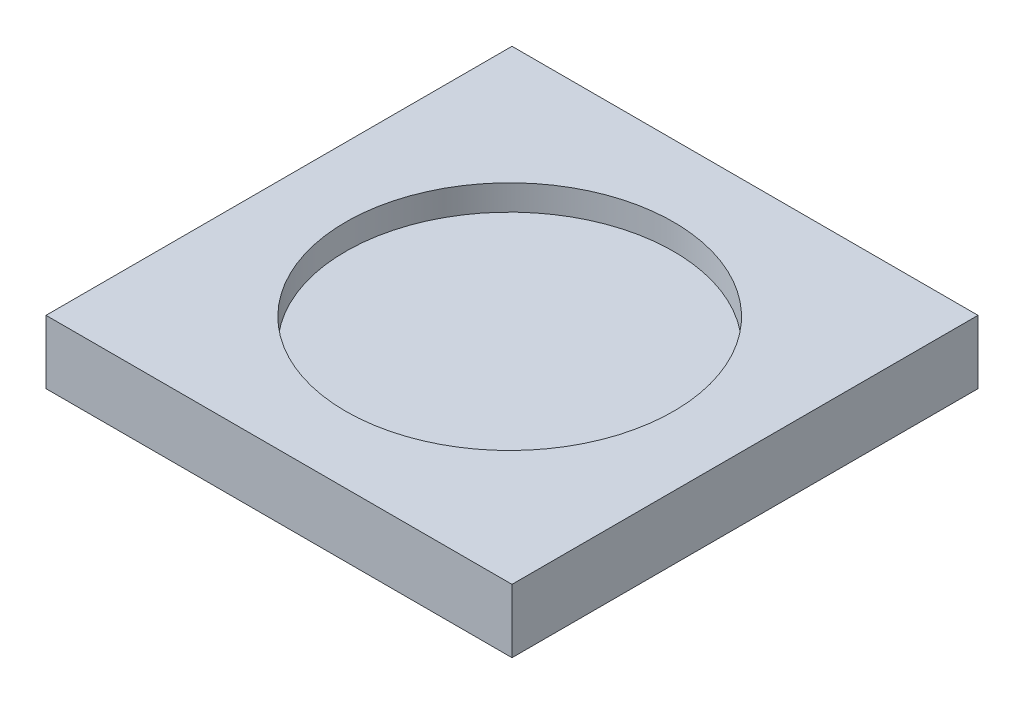
ISO-10303-21;
HEADER;
FILE_DESCRIPTION(('STEP AP214'),'2;1');
FILE_NAME('part.step','',(''),(''),'','','');
FILE_SCHEMA(('AUTOMOTIVE_DESIGN { 1 0 10303 214 1 1 1 1 }'));
ENDSEC;
DATA;
#1=APPLICATION_CONTEXT('core data for automotive mechanical design processes');
#2=APPLICATION_PROTOCOL_DEFINITION('international standard','automotive_design',2000,#1);
#3=PRODUCT_CONTEXT('',#1,'mechanical');
#4=PRODUCT('Part','Part','',(#3));
#5=PRODUCT_RELATED_PRODUCT_CATEGORY('part','',(#4));
#6=PRODUCT_DEFINITION_FORMATION('','',#4);
#7=PRODUCT_DEFINITION_CONTEXT('part definition',#1,'design');
#8=PRODUCT_DEFINITION('design','',#6,#7);
#9=PRODUCT_DEFINITION_SHAPE('','',#8);
#10=(LENGTH_UNIT() NAMED_UNIT(*) SI_UNIT(.MILLI.,.METRE.));
#11=(NAMED_UNIT(*) PLANE_ANGLE_UNIT() SI_UNIT($,.RADIAN.));
#12=(NAMED_UNIT(*) SI_UNIT($,.STERADIAN.) SOLID_ANGLE_UNIT());
#13=UNCERTAINTY_MEASURE_WITH_UNIT(LENGTH_MEASURE(1.E-05),#10,'distance_accuracy_value','');
#14=(GEOMETRIC_REPRESENTATION_CONTEXT(3) GLOBAL_UNCERTAINTY_ASSIGNED_CONTEXT((#13)) GLOBAL_UNIT_ASSIGNED_CONTEXT((#10,
#11,#12)) REPRESENTATION_CONTEXT('',''));
#15=CARTESIAN_POINT('',(0.,0.,0.));
#16=DIRECTION('',(0.,0.,1.));
#17=DIRECTION('',(1.,0.,0.));
#18=AXIS2_PLACEMENT_3D('',#15,#16,#17);
#19=CARTESIAN_POINT('',(0.,5.,0.));
#20=DIRECTION('',(-1.,0.,0.));
#21=DIRECTION('',(0.,0.,1.));
#22=AXIS2_PLACEMENT_3D('',#19,#20,#21);
#23=PLANE('',#22);
#24=DIRECTION('',(0.,0.,-1.));
#25=VECTOR('',#24,1.);
#26=CARTESIAN_POINT('',(0.,0.,0.));
#27=LINE('',#26,#25);
#28=CARTESIAN_POINT('',(0.,0.,0.));
#29=VERTEX_POINT('',#28);
#30=CARTESIAN_POINT('',(0.,0.,-36.6666666667));
#31=VERTEX_POINT('',#30);
#32=EDGE_CURVE('E96',#29,#31,#27,.T.);
#33=ORIENTED_EDGE('',*,*,#32,.T.);
#34=DIRECTION('',(0.,-1.,0.));
#35=VECTOR('',#34,1.);
#36=CARTESIAN_POINT('',(0.,5.,-36.6666666667));
#37=LINE('',#36,#35);
#38=CARTESIAN_POINT('',(0.,5.,-36.6666666667));
#39=VERTEX_POINT('',#38);
#40=EDGE_CURVE('E11',#39,#31,#37,.T.);
#41=ORIENTED_EDGE('',*,*,#40,.F.);
#42=DIRECTION('',(0.,0.,-1.));
#43=VECTOR('',#42,1.);
#44=CARTESIAN_POINT('',(0.,5.,0.));
#45=LINE('',#44,#43);
#46=CARTESIAN_POINT('',(0.,5.,0.));
#47=VERTEX_POINT('',#46);
#48=EDGE_CURVE('E84',#47,#39,#45,.T.);
#49=ORIENTED_EDGE('',*,*,#48,.F.);
#50=DIRECTION('',(0.,-1.,0.));
#51=VECTOR('',#50,1.);
#52=CARTESIAN_POINT('',(0.,5.,0.));
#53=LINE('',#52,#51);
#54=EDGE_CURVE('E92',#47,#29,#53,.T.);
#55=ORIENTED_EDGE('',*,*,#54,.T.);
#56=EDGE_LOOP('',(#33,#41,#49,#55));
#57=FACE_BOUND('',#56,.T.);
#58=ADVANCED_FACE('F33',(#57),#23,.F.);
#59=CARTESIAN_POINT('',(0.,5.,-36.6666666667));
#60=DIRECTION('',(0.,0.,1.));
#61=DIRECTION('',(1.,0.,0.));
#62=AXIS2_PLACEMENT_3D('',#59,#60,#61);
#63=PLANE('',#62);
#64=DIRECTION('',(-1.,0.,0.));
#65=VECTOR('',#64,1.);
#66=CARTESIAN_POINT('',(0.,0.,-36.6666666667));
#67=LINE('',#66,#65);
#68=CARTESIAN_POINT('',(-36.6666666667,0.,-36.6666666667));
#69=VERTEX_POINT('',#68);
#70=EDGE_CURVE('E88',#31,#69,#67,.T.);
#71=ORIENTED_EDGE('',*,*,#70,.T.);
#72=DIRECTION('',(0.,-1.,0.));
#73=VECTOR('',#72,1.);
#74=CARTESIAN_POINT('',(-36.6666666667,5.,-36.6666666667));
#75=LINE('',#74,#73);
#76=CARTESIAN_POINT('',(-36.6666666667,5.,-36.6666666667));
#77=VERTEX_POINT('',#76);
#78=EDGE_CURVE('E41',#77,#69,#75,.T.);
#79=ORIENTED_EDGE('',*,*,#78,.F.);
#80=DIRECTION('',(-1.,0.,0.));
#81=VECTOR('',#80,1.);
#82=CARTESIAN_POINT('',(0.,5.,-36.6666666667));
#83=LINE('',#82,#81);
#84=EDGE_CURVE('E79',#39,#77,#83,.T.);
#85=ORIENTED_EDGE('',*,*,#84,.F.);
#86=ORIENTED_EDGE('',*,*,#40,.T.);
#87=EDGE_LOOP('',(#71,#79,#85,#86));
#88=FACE_BOUND('',#87,.T.);
#89=ADVANCED_FACE('F87',(#88),#63,.F.);
#90=CARTESIAN_POINT('',(-36.6666666667,5.,0.));
#91=DIRECTION('',(1.,0.,0.));
#92=DIRECTION('',(0.,0.,-1.));
#93=AXIS2_PLACEMENT_3D('',#90,#91,#92);
#94=PLANE('',#93);
#95=DIRECTION('',(0.,0.,1.));
#96=VECTOR('',#95,1.);
#97=CARTESIAN_POINT('',(-36.6666666667,0.,0.));
#98=LINE('',#97,#96);
#99=CARTESIAN_POINT('',(-36.6666666667,0.,0.));
#100=VERTEX_POINT('',#99);
#101=EDGE_CURVE('E66',#69,#100,#98,.T.);
#102=ORIENTED_EDGE('',*,*,#101,.T.);
#103=DIRECTION('',(0.,-1.,0.));
#104=VECTOR('',#103,1.);
#105=CARTESIAN_POINT('',(-36.6666666667,5.,0.));
#106=LINE('',#105,#104);
#107=CARTESIAN_POINT('',(-36.6666666667,5.,0.));
#108=VERTEX_POINT('',#107);
#109=EDGE_CURVE('E89',#108,#100,#106,.T.);
#110=ORIENTED_EDGE('',*,*,#109,.F.);
#111=DIRECTION('',(0.,0.,1.));
#112=VECTOR('',#111,1.);
#113=CARTESIAN_POINT('',(-36.6666666667,5.,0.));
#114=LINE('',#113,#112);
#115=EDGE_CURVE('E82',#77,#108,#114,.T.);
#116=ORIENTED_EDGE('',*,*,#115,.F.);
#117=ORIENTED_EDGE('',*,*,#78,.T.);
#118=EDGE_LOOP('',(#102,#110,#116,#117));
#119=FACE_BOUND('',#118,.T.);
#120=ADVANCED_FACE('F90',(#119),#94,.F.);
#121=CARTESIAN_POINT('',(0.,5.,0.));
#122=DIRECTION('',(0.,0.,-1.));
#123=DIRECTION('',(-1.,0.,0.));
#124=AXIS2_PLACEMENT_3D('',#121,#122,#123);
#125=PLANE('',#124);
#126=DIRECTION('',(1.,0.,0.));
#127=VECTOR('',#126,1.);
#128=CARTESIAN_POINT('',(0.,0.,0.));
#129=LINE('',#128,#127);
#130=EDGE_CURVE('E72',#100,#29,#129,.T.);
#131=ORIENTED_EDGE('',*,*,#130,.T.);
#132=ORIENTED_EDGE('',*,*,#54,.F.);
#133=DIRECTION('',(1.,0.,0.));
#134=VECTOR('',#133,1.);
#135=CARTESIAN_POINT('',(0.,5.,0.));
#136=LINE('',#135,#134);
#137=EDGE_CURVE('E49',#108,#47,#136,.T.);
#138=ORIENTED_EDGE('',*,*,#137,.F.);
#139=ORIENTED_EDGE('',*,*,#109,.T.);
#140=EDGE_LOOP('',(#131,#132,#138,#139));
#141=FACE_BOUND('',#140,.T.);
#142=ADVANCED_FACE('F104',(#141),#125,.F.);
#143=CARTESIAN_POINT('',(0.,5.,0.));
#144=DIRECTION('',(0.,1.,0.));
#145=DIRECTION('',(0.,0.,1.));
#146=AXIS2_PLACEMENT_3D('',#143,#144,#145);
#147=PLANE('',#146);
#148=CARTESIAN_POINT('',(-18.33333333335,5.,-18.1502945788166));
#149=DIRECTION('',(0.,1.,0.));
#150=DIRECTION('',(0.,0.,1.));
#151=AXIS2_PLACEMENT_3D('',#148,#149,#150);
#152=CIRCLE('',#151,12.9);
#153=CARTESIAN_POINT('',(-18.33333333335,5.,-5.25029457881664));
#154=VERTEX_POINT('',#153);
#155=EDGE_CURVE('E110',#154,#154,#152,.T.);
#156=ORIENTED_EDGE('',*,*,#155,.F.);
#157=EDGE_LOOP('',(#156));
#158=FACE_BOUND('',#157,.T.);
#159=ORIENTED_EDGE('',*,*,#48,.T.);
#160=ORIENTED_EDGE('',*,*,#84,.T.);
#161=ORIENTED_EDGE('',*,*,#115,.T.);
#162=ORIENTED_EDGE('',*,*,#137,.T.);
#163=EDGE_LOOP('',(#159,#160,#161,#162));
#164=FACE_BOUND('',#163,.T.);
#165=ADVANCED_FACE('F80',(#158,#164),#147,.T.);
#166=CARTESIAN_POINT('',(0.,0.,0.));
#167=DIRECTION('',(0.,1.,0.));
#168=DIRECTION('',(0.,0.,1.));
#169=AXIS2_PLACEMENT_3D('',#166,#167,#168);
#170=PLANE('',#169);
#171=ORIENTED_EDGE('',*,*,#32,.F.);
#172=ORIENTED_EDGE('',*,*,#130,.F.);
#173=ORIENTED_EDGE('',*,*,#101,.F.);
#174=ORIENTED_EDGE('',*,*,#70,.F.);
#175=EDGE_LOOP('',(#171,#172,#173,#174));
#176=FACE_BOUND('',#175,.T.);
#177=ADVANCED_FACE('F107',(#176),#170,.F.);
#178=CARTESIAN_POINT('',(-18.33333333335,3.,-18.1502945788166));
#179=DIRECTION('',(0.,1.,0.));
#180=DIRECTION('',(0.,0.,1.));
#181=AXIS2_PLACEMENT_3D('',#178,#179,#180);
#182=CYLINDRICAL_SURFACE('',#181,12.9);
#183=CARTESIAN_POINT('',(-18.33333333335,3.,-18.1502945788166));
#184=DIRECTION('',(0.,1.,0.));
#185=DIRECTION('',(0.,0.,1.));
#186=AXIS2_PLACEMENT_3D('',#183,#184,#185);
#187=CIRCLE('',#186,12.9);
#188=CARTESIAN_POINT('',(-18.33333333335,3.,-5.25029457881664));
#189=VERTEX_POINT('',#188);
#190=EDGE_CURVE('E99',#189,#189,#187,.T.);
#191=ORIENTED_EDGE('',*,*,#190,.F.);
#192=EDGE_LOOP('',(#191));
#193=FACE_BOUND('',#192,.T.);
#194=ORIENTED_EDGE('',*,*,#155,.T.);
#195=EDGE_LOOP('',(#194));
#196=FACE_BOUND('',#195,.T.);
#197=ADVANCED_FACE('F118',(#193,#196),#182,.F.);
#198=CARTESIAN_POINT('',(-18.33333333335,3.,-18.1502945788166));
#199=DIRECTION('',(0.,1.,0.));
#200=DIRECTION('',(0.,0.,1.));
#201=AXIS2_PLACEMENT_3D('',#198,#199,#200);
#202=PLANE('',#201);
#203=ORIENTED_EDGE('',*,*,#190,.T.);
#204=EDGE_LOOP('',(#203));
#205=FACE_BOUND('',#204,.T.);
#206=ADVANCED_FACE('F116',(#205),#202,.T.);
#207=CLOSED_SHELL('',(#58,#89,#120,#142,#165,#177,#197,#206));
#208=MANIFOLD_SOLID_BREP('B2',#207);
#209=ADVANCED_BREP_SHAPE_REPRESENTATION('',(#18,#208),#14);
#210=SHAPE_DEFINITION_REPRESENTATION(#9,#209);
ENDSEC;
END-ISO-10303-21;
